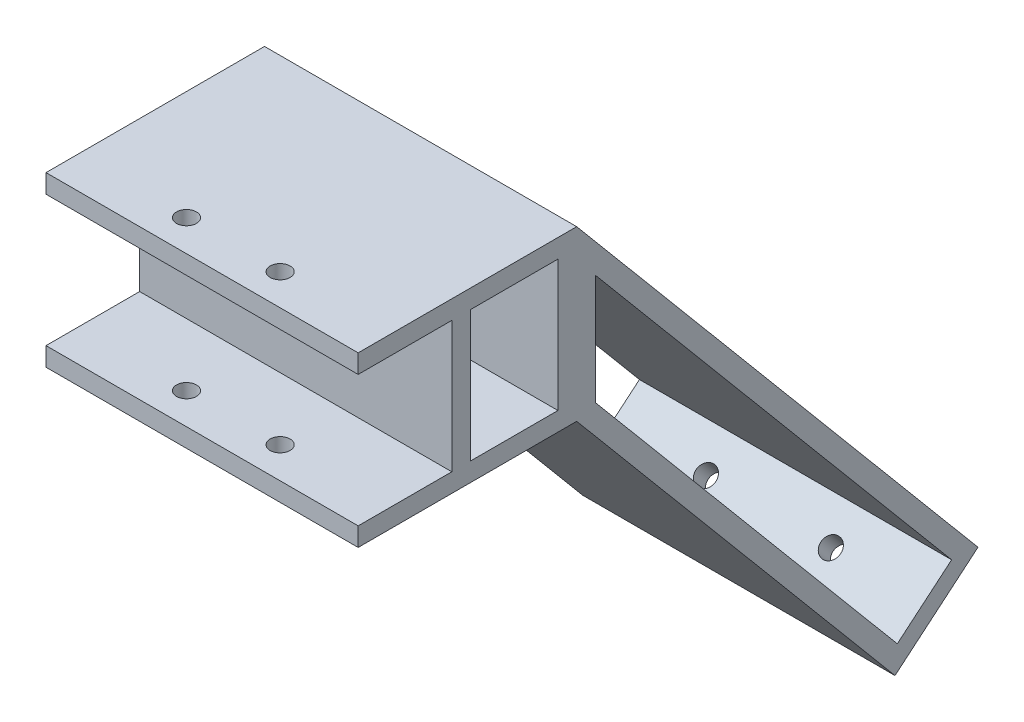
ISO-10303-21;
HEADER;
FILE_DESCRIPTION(('STEP AP214'),'2;1');
FILE_NAME('part.step','',(''),(''),'','','');
FILE_SCHEMA(('AUTOMOTIVE_DESIGN { 1 0 10303 214 1 1 1 1 }'));
ENDSEC;
DATA;
#1=APPLICATION_CONTEXT('core data for automotive mechanical design processes');
#2=APPLICATION_PROTOCOL_DEFINITION('international standard','automotive_design',2000,#1);
#3=PRODUCT_CONTEXT('',#1,'mechanical');
#4=PRODUCT('Part','Part','',(#3));
#5=PRODUCT_RELATED_PRODUCT_CATEGORY('part','',(#4));
#6=PRODUCT_DEFINITION_FORMATION('','',#4);
#7=PRODUCT_DEFINITION_CONTEXT('part definition',#1,'design');
#8=PRODUCT_DEFINITION('design','',#6,#7);
#9=PRODUCT_DEFINITION_SHAPE('','',#8);
#10=(LENGTH_UNIT() NAMED_UNIT(*) SI_UNIT(.MILLI.,.METRE.));
#11=(NAMED_UNIT(*) PLANE_ANGLE_UNIT() SI_UNIT($,.RADIAN.));
#12=(NAMED_UNIT(*) SI_UNIT($,.STERADIAN.) SOLID_ANGLE_UNIT());
#13=UNCERTAINTY_MEASURE_WITH_UNIT(LENGTH_MEASURE(1.E-05),#10,'distance_accuracy_value','');
#14=(GEOMETRIC_REPRESENTATION_CONTEXT(3) GLOBAL_UNCERTAINTY_ASSIGNED_CONTEXT((#13)) GLOBAL_UNIT_ASSIGNED_CONTEXT((#10,
#11,#12)) REPRESENTATION_CONTEXT('',''));
#15=CARTESIAN_POINT('',(0.,0.,0.));
#16=DIRECTION('',(0.,0.,1.));
#17=DIRECTION('',(1.,0.,0.));
#18=AXIS2_PLACEMENT_3D('',#15,#16,#17);
#19=CARTESIAN_POINT('',(0.,0.,35.));
#20=DIRECTION('',(0.,0.,1.));
#21=DIRECTION('',(1.,0.,0.));
#22=AXIS2_PLACEMENT_3D('',#19,#20,#21);
#23=PLANE('',#22);
#24=DIRECTION('',(-1.,0.,0.));
#25=VECTOR('',#24,1.);
#26=CARTESIAN_POINT('',(-21.1991434689508,10.3297644539615,35.));
#27=LINE('',#26,#25);
#28=CARTESIAN_POINT('',(28.8008565310493,10.3297644539615,35.));
#29=VERTEX_POINT('',#28);
#30=CARTESIAN_POINT('',(-21.1991434689508,10.3297644539615,35.));
#31=VERTEX_POINT('',#30);
#32=EDGE_CURVE('E328',#29,#31,#27,.T.);
#33=ORIENTED_EDGE('',*,*,#32,.F.);
#34=DIRECTION('',(0.,1.,0.));
#35=VECTOR('',#34,1.);
#36=CARTESIAN_POINT('',(28.8008565310493,13.3297644539615,35.));
#37=LINE('',#36,#35);
#38=CARTESIAN_POINT('',(28.8008565310493,13.3297644539615,35.));
#39=VERTEX_POINT('',#38);
#40=EDGE_CURVE('E366',#29,#39,#37,.T.);
#41=ORIENTED_EDGE('',*,*,#40,.T.);
#42=DIRECTION('',(-1.,0.,0.));
#43=VECTOR('',#42,1.);
#44=CARTESIAN_POINT('',(-21.1991434689508,13.3297644539615,35.));
#45=LINE('',#44,#43);
#46=CARTESIAN_POINT('',(-21.1991434689508,13.3297644539615,35.));
#47=VERTEX_POINT('',#46);
#48=EDGE_CURVE('E371',#39,#47,#45,.T.);
#49=ORIENTED_EDGE('',*,*,#48,.T.);
#50=DIRECTION('',(0.,-1.,0.));
#51=VECTOR('',#50,1.);
#52=CARTESIAN_POINT('',(-21.1991434689508,13.3297644539615,35.));
#53=LINE('',#52,#51);
#54=EDGE_CURVE('E358',#47,#31,#53,.T.);
#55=ORIENTED_EDGE('',*,*,#54,.T.);
#56=EDGE_LOOP('',(#33,#41,#49,#55));
#57=FACE_BOUND('',#56,.T.);
#58=ADVANCED_FACE('F45',(#57),#23,.T.);
#59=CARTESIAN_POINT('',(-21.1991434689508,13.3297644539615,35.));
#60=DIRECTION('',(1.,0.,0.));
#61=DIRECTION('',(0.,1.,0.));
#62=AXIS2_PLACEMENT_3D('',#59,#60,#61);
#63=PLANE('',#62);
#64=DIRECTION('',(0.,-0.76604444311898,-0.642787609686537));
#65=VECTOR('',#64,1.);
#66=CARTESIAN_POINT('',(-21.1991434689508,-12.57832484324,-3.));
#67=LINE('',#66,#65);
#68=CARTESIAN_POINT('',(-21.1991434689508,-12.57832484324,-3.));
#69=VERTEX_POINT('',#68);
#70=CARTESIAN_POINT('',(-21.1991434689508,-70.2039333010163,-51.3536268032863));
#71=VERTEX_POINT('',#70);
#72=EDGE_CURVE('E182',#69,#71,#67,.T.);
#73=ORIENTED_EDGE('',*,*,#72,.T.);
#74=DIRECTION('',(0.,0.642787609686538,-0.766044443118979));
#75=VECTOR('',#74,1.);
#76=CARTESIAN_POINT('',(-21.1991434689508,-70.2039333010163,-51.3536268032863));
#77=LINE('',#76,#75);
#78=CARTESIAN_POINT('',(-21.1991434689508,-62.9049093576392,-60.0522648102372));
#79=VERTEX_POINT('',#78);
#80=EDGE_CURVE('E175',#71,#79,#77,.T.);
#81=ORIENTED_EDGE('',*,*,#80,.T.);
#82=DIRECTION('',(0.,0.76604444311898,0.642787609686537));
#83=VECTOR('',#82,1.);
#84=CARTESIAN_POINT('',(-21.1991434689508,-62.9049093576392,-60.0522648102372));
#85=LINE('',#84,#83);
#86=CARTESIAN_POINT('',(-21.1991434689508,5.08733219559755,-2.99999999999998));
#87=VERTEX_POINT('',#86);
#88=EDGE_CURVE('E185',#79,#87,#85,.T.);
#89=ORIENTED_EDGE('',*,*,#88,.T.);
#90=DIRECTION('',(0.,-1.,0.));
#91=VECTOR('',#90,1.);
#92=CARTESIAN_POINT('',(-21.1991434689508,5.08733219559754,-3.));
#93=LINE('',#92,#91);
#94=EDGE_CURVE('E63',#87,#69,#93,.T.);
#95=ORIENTED_EDGE('',*,*,#94,.T.);
#96=EDGE_LOOP('',(#73,#81,#89,#95));
#97=FACE_BOUND('',#96,.T.);
#98=DIRECTION('',(0.,0.,1.));
#99=VECTOR('',#98,1.);
#100=CARTESIAN_POINT('',(-21.1991434689507,-10.6702355460385,3.));
#101=LINE('',#100,#99);
#102=CARTESIAN_POINT('',(-21.1991434689507,-10.6702355460385,3.));
#103=VERTEX_POINT('',#102);
#104=CARTESIAN_POINT('',(-21.1991434689507,-10.6702355460385,17.));
#105=VERTEX_POINT('',#104);
#106=EDGE_CURVE('E273',#103,#105,#101,.T.);
#107=ORIENTED_EDGE('',*,*,#106,.F.);
#108=DIRECTION('',(0.,-1.,0.));
#109=VECTOR('',#108,1.);
#110=CARTESIAN_POINT('',(-21.1991434689508,10.3297644539615,3.));
#111=LINE('',#110,#109);
#112=CARTESIAN_POINT('',(-21.1991434689508,10.3297644539615,3.));
#113=VERTEX_POINT('',#112);
#114=EDGE_CURVE('E250',#113,#103,#111,.T.);
#115=ORIENTED_EDGE('',*,*,#114,.F.);
#116=DIRECTION('',(0.,0.,-1.));
#117=VECTOR('',#116,1.);
#118=CARTESIAN_POINT('',(-21.1991434689508,10.3297644539615,3.));
#119=LINE('',#118,#117);
#120=CARTESIAN_POINT('',(-21.1991434689508,10.3297644539615,17.));
#121=VERTEX_POINT('',#120);
#122=EDGE_CURVE('E258',#121,#113,#119,.T.);
#123=ORIENTED_EDGE('',*,*,#122,.F.);
#124=DIRECTION('',(0.,1.,0.));
#125=VECTOR('',#124,1.);
#126=CARTESIAN_POINT('',(-21.1991434689508,10.3297644539615,17.));
#127=LINE('',#126,#125);
#128=EDGE_CURVE('E277',#105,#121,#127,.T.);
#129=ORIENTED_EDGE('',*,*,#128,.F.);
#130=EDGE_LOOP('',(#107,#115,#123,#129));
#131=FACE_BOUND('',#130,.T.);
#132=DIRECTION('',(0.,-1.,0.));
#133=VECTOR('',#132,1.);
#134=CARTESIAN_POINT('',(-21.1991434689508,10.3297644539615,20.));
#135=LINE('',#134,#133);
#136=CARTESIAN_POINT('',(-21.1991434689508,10.3297644539615,20.));
#137=VERTEX_POINT('',#136);
#138=CARTESIAN_POINT('',(-21.1991434689508,-10.6702355460385,20.));
#139=VERTEX_POINT('',#138);
#140=EDGE_CURVE('E323',#137,#139,#135,.T.);
#141=ORIENTED_EDGE('',*,*,#140,.F.);
#142=DIRECTION('',(0.,0.,1.));
#143=VECTOR('',#142,1.);
#144=CARTESIAN_POINT('',(-21.1991434689508,10.3297644539615,20.));
#145=LINE('',#144,#143);
#146=EDGE_CURVE('E344',#137,#31,#145,.T.);
#147=ORIENTED_EDGE('',*,*,#146,.T.);
#148=ORIENTED_EDGE('',*,*,#54,.F.);
#149=DIRECTION('',(0.,0.,-1.));
#150=VECTOR('',#149,1.);
#151=CARTESIAN_POINT('',(-21.1991434689508,13.3297644539615,35.));
#152=LINE('',#151,#150);
#153=CARTESIAN_POINT('',(-21.1991434689508,13.3297644539614,0.));
#154=VERTEX_POINT('',#153);
#155=EDGE_CURVE('E374',#47,#154,#152,.T.);
#156=ORIENTED_EDGE('',*,*,#155,.T.);
#157=DIRECTION('',(0.,0.766044443118979,0.642787609686538));
#158=VECTOR('',#157,1.);
#159=CARTESIAN_POINT('',(-21.1991434689507,-63.2746798579365,-64.2787609686538));
#160=LINE('',#159,#158);
#161=CARTESIAN_POINT('',(-21.1991434689507,-63.2746798579365,-64.2787609686538));
#162=VERTEX_POINT('',#161);
#163=EDGE_CURVE('E233',#162,#154,#160,.T.);
#164=ORIENTED_EDGE('',*,*,#163,.F.);
#165=DIRECTION('',(0.,0.642787609686537,-0.76604444311898));
#166=VECTOR('',#165,1.);
#167=CARTESIAN_POINT('',(-21.1991434689507,-74.4304294594329,-50.983856302989));
#168=LINE('',#167,#166);
#169=CARTESIAN_POINT('',(-21.1991434689507,-74.4304294594329,-50.983856302989));
#170=VERTEX_POINT('',#169);
#171=EDGE_CURVE('E228',#170,#162,#168,.T.);
#172=ORIENTED_EDGE('',*,*,#171,.F.);
#173=DIRECTION('',(0.,-0.766044443118979,-0.642787609686538));
#174=VECTOR('',#173,1.);
#175=CARTESIAN_POINT('',(-21.1991434689507,-13.6702355460386,0.));
#176=LINE('',#175,#174);
#177=CARTESIAN_POINT('',(-21.1991434689507,-13.6702355460386,0.));
#178=VERTEX_POINT('',#177);
#179=EDGE_CURVE('E224',#178,#170,#176,.T.);
#180=ORIENTED_EDGE('',*,*,#179,.F.);
#181=DIRECTION('',(0.,0.,-1.));
#182=VECTOR('',#181,1.);
#183=CARTESIAN_POINT('',(-21.1991434689507,-13.6702355460385,35.));
#184=LINE('',#183,#182);
#185=CARTESIAN_POINT('',(-21.1991434689507,-13.6702355460385,35.));
#186=VERTEX_POINT('',#185);
#187=EDGE_CURVE('E11',#186,#178,#184,.T.);
#188=ORIENTED_EDGE('',*,*,#187,.F.);
#189=CARTESIAN_POINT('',(-21.1991434689507,-10.6702355460385,35.));
#190=VERTEX_POINT('',#189);
#191=EDGE_CURVE('E363',#190,#186,#53,.T.);
#192=ORIENTED_EDGE('',*,*,#191,.F.);
#193=DIRECTION('',(0.,0.,1.));
#194=VECTOR('',#193,1.);
#195=CARTESIAN_POINT('',(-21.1991434689508,-10.6702355460385,20.));
#196=LINE('',#195,#194);
#197=EDGE_CURVE('E339',#139,#190,#196,.T.);
#198=ORIENTED_EDGE('',*,*,#197,.F.);
#199=EDGE_LOOP('',(#141,#147,#148,#156,#164,#172,#180,#188,#192,#198));
#200=FACE_BOUND('',#199,.T.);
#201=ADVANCED_FACE('F47',(#97,#131,#200),#63,.F.);
#202=CARTESIAN_POINT('',(-21.1991434689507,-13.6702355460385,35.));
#203=DIRECTION('',(0.,1.,0.));
#204=DIRECTION('',(0.,0.,1.));
#205=AXIS2_PLACEMENT_3D('',#202,#203,#204);
#206=PLANE('',#205);
#207=CARTESIAN_POINT('',(11.3008565310493,-13.6702355460385,30.));
#208=DIRECTION('',(0.,-1.,0.));
#209=DIRECTION('',(0.,0.,-1.));
#210=AXIS2_PLACEMENT_3D('',#207,#208,#209);
#211=CIRCLE('',#210,1.6);
#212=CARTESIAN_POINT('',(11.3008565310493,-13.6702355460385,28.4));
#213=VERTEX_POINT('',#212);
#214=EDGE_CURVE('E302',#213,#213,#211,.T.);
#215=ORIENTED_EDGE('',*,*,#214,.F.);
#216=EDGE_LOOP('',(#215));
#217=FACE_BOUND('',#216,.T.);
#218=CARTESIAN_POINT('',(-3.69914346895074,-13.6702355460385,30.));
#219=DIRECTION('',(0.,-1.,0.));
#220=DIRECTION('',(0.,0.,-1.));
#221=AXIS2_PLACEMENT_3D('',#218,#219,#220);
#222=CIRCLE('',#221,1.6);
#223=CARTESIAN_POINT('',(-3.69914346895074,-13.6702355460385,28.4));
#224=VERTEX_POINT('',#223);
#225=EDGE_CURVE('E306',#224,#224,#222,.T.);
#226=ORIENTED_EDGE('',*,*,#225,.F.);
#227=EDGE_LOOP('',(#226));
#228=FACE_BOUND('',#227,.T.);
#229=DIRECTION('',(1.,0.,0.));
#230=VECTOR('',#229,1.);
#231=CARTESIAN_POINT('',(-21.1991434689507,-13.6702355460385,0.));
#232=LINE('',#231,#230);
#233=CARTESIAN_POINT('',(28.8008565310493,-13.6702355460385,0.));
#234=VERTEX_POINT('',#233);
#235=EDGE_CURVE('E348',#178,#234,#232,.T.);
#236=ORIENTED_EDGE('',*,*,#235,.T.);
#237=DIRECTION('',(0.,0.,-1.));
#238=VECTOR('',#237,1.);
#239=CARTESIAN_POINT('',(28.8008565310493,-13.6702355460385,35.));
#240=LINE('',#239,#238);
#241=CARTESIAN_POINT('',(28.8008565310493,-13.6702355460385,35.));
#242=VERTEX_POINT('',#241);
#243=EDGE_CURVE('E55',#242,#234,#240,.T.);
#244=ORIENTED_EDGE('',*,*,#243,.F.);
#245=DIRECTION('',(1.,0.,0.));
#246=VECTOR('',#245,1.);
#247=CARTESIAN_POINT('',(-21.1991434689507,-13.6702355460385,35.));
#248=LINE('',#247,#246);
#249=EDGE_CURVE('E362',#186,#242,#248,.T.);
#250=ORIENTED_EDGE('',*,*,#249,.F.);
#251=ORIENTED_EDGE('',*,*,#187,.T.);
#252=EDGE_LOOP('',(#236,#244,#250,#251));
#253=FACE_BOUND('',#252,.T.);
#254=ADVANCED_FACE('F434',(#217,#228,#253),#206,.F.);
#255=CARTESIAN_POINT('',(28.8008565310493,13.3297644539615,35.));
#256=DIRECTION('',(-1.,0.,0.));
#257=DIRECTION('',(0.,-1.,0.));
#258=AXIS2_PLACEMENT_3D('',#255,#256,#257);
#259=PLANE('',#258);
#260=DIRECTION('',(0.,0.76604444311898,0.642787609686537));
#261=VECTOR('',#260,1.);
#262=CARTESIAN_POINT('',(28.8008565310493,-62.9049093576392,-60.0522648102372));
#263=LINE('',#262,#261);
#264=CARTESIAN_POINT('',(28.8008565310493,-62.9049093576392,-60.0522648102372));
#265=VERTEX_POINT('',#264);
#266=CARTESIAN_POINT('',(28.8008565310493,5.08733219559755,-3.));
#267=VERTEX_POINT('',#266);
#268=EDGE_CURVE('E209',#265,#267,#263,.T.);
#269=ORIENTED_EDGE('',*,*,#268,.F.);
#270=DIRECTION('',(0.,0.642787609686538,-0.766044443118979));
#271=VECTOR('',#270,1.);
#272=CARTESIAN_POINT('',(28.8008565310493,-70.2039333010163,-51.3536268032863));
#273=LINE('',#272,#271);
#274=CARTESIAN_POINT('',(28.8008565310493,-70.2039333010163,-51.3536268032863));
#275=VERTEX_POINT('',#274);
#276=EDGE_CURVE('E71',#275,#265,#273,.T.);
#277=ORIENTED_EDGE('',*,*,#276,.F.);
#278=DIRECTION('',(0.,-0.76604444311898,-0.642787609686537));
#279=VECTOR('',#278,1.);
#280=CARTESIAN_POINT('',(28.8008565310493,-12.5783248432399,-3.));
#281=LINE('',#280,#279);
#282=CARTESIAN_POINT('',(28.8008565310493,-12.5783248432399,-3.));
#283=VERTEX_POINT('',#282);
#284=EDGE_CURVE('E193',#283,#275,#281,.T.);
#285=ORIENTED_EDGE('',*,*,#284,.F.);
#286=DIRECTION('',(0.,-1.,0.));
#287=VECTOR('',#286,1.);
#288=CARTESIAN_POINT('',(28.8008565310493,5.08733219559755,-3.));
#289=LINE('',#288,#287);
#290=EDGE_CURVE('E197',#267,#283,#289,.T.);
#291=ORIENTED_EDGE('',*,*,#290,.F.);
#292=EDGE_LOOP('',(#269,#277,#285,#291));
#293=FACE_BOUND('',#292,.T.);
#294=DIRECTION('',(0.,0.,-1.));
#295=VECTOR('',#294,1.);
#296=CARTESIAN_POINT('',(28.8008565310493,10.3297644539615,3.));
#297=LINE('',#296,#295);
#298=CARTESIAN_POINT('',(28.8008565310493,10.3297644539615,17.));
#299=VERTEX_POINT('',#298);
#300=CARTESIAN_POINT('',(28.8008565310493,10.3297644539615,3.));
#301=VERTEX_POINT('',#300);
#302=EDGE_CURVE('E266',#299,#301,#297,.T.);
#303=ORIENTED_EDGE('',*,*,#302,.T.);
#304=DIRECTION('',(0.,-1.,0.));
#305=VECTOR('',#304,1.);
#306=CARTESIAN_POINT('',(28.8008565310493,10.3297644539615,3.));
#307=LINE('',#306,#305);
#308=CARTESIAN_POINT('',(28.8008565310493,-10.6702355460385,3.));
#309=VERTEX_POINT('',#308);
#310=EDGE_CURVE('E253',#301,#309,#307,.T.);
#311=ORIENTED_EDGE('',*,*,#310,.T.);
#312=DIRECTION('',(0.,0.,1.));
#313=VECTOR('',#312,1.);
#314=CARTESIAN_POINT('',(28.8008565310493,-10.6702355460385,3.));
#315=LINE('',#314,#313);
#316=CARTESIAN_POINT('',(28.8008565310493,-10.6702355460385,17.));
#317=VERTEX_POINT('',#316);
#318=EDGE_CURVE('E257',#309,#317,#315,.T.);
#319=ORIENTED_EDGE('',*,*,#318,.T.);
#320=DIRECTION('',(0.,1.,0.));
#321=VECTOR('',#320,1.);
#322=CARTESIAN_POINT('',(28.8008565310493,10.3297644539615,17.));
#323=LINE('',#322,#321);
#324=EDGE_CURVE('E262',#317,#299,#323,.T.);
#325=ORIENTED_EDGE('',*,*,#324,.T.);
#326=EDGE_LOOP('',(#303,#311,#319,#325));
#327=FACE_BOUND('',#326,.T.);
#328=ORIENTED_EDGE('',*,*,#40,.F.);
#329=DIRECTION('',(0.,0.,1.));
#330=VECTOR('',#329,1.);
#331=CARTESIAN_POINT('',(28.8008565310493,10.3297644539615,20.));
#332=LINE('',#331,#330);
#333=CARTESIAN_POINT('',(28.8008565310493,10.3297644539615,20.));
#334=VERTEX_POINT('',#333);
#335=EDGE_CURVE('E349',#334,#29,#332,.T.);
#336=ORIENTED_EDGE('',*,*,#335,.F.);
#337=DIRECTION('',(0.,1.,0.));
#338=VECTOR('',#337,1.);
#339=CARTESIAN_POINT('',(28.8008565310493,10.3297644539615,20.));
#340=LINE('',#339,#338);
#341=CARTESIAN_POINT('',(28.8008565310493,-10.6702355460385,20.));
#342=VERTEX_POINT('',#341);
#343=EDGE_CURVE('E332',#342,#334,#340,.T.);
#344=ORIENTED_EDGE('',*,*,#343,.F.);
#345=DIRECTION('',(0.,0.,1.));
#346=VECTOR('',#345,1.);
#347=CARTESIAN_POINT('',(28.8008565310493,-10.6702355460385,20.));
#348=LINE('',#347,#346);
#349=CARTESIAN_POINT('',(28.8008565310493,-10.6702355460385,35.));
#350=VERTEX_POINT('',#349);
#351=EDGE_CURVE('E352',#342,#350,#348,.T.);
#352=ORIENTED_EDGE('',*,*,#351,.T.);
#353=EDGE_CURVE('E367',#242,#350,#37,.T.);
#354=ORIENTED_EDGE('',*,*,#353,.F.);
#355=ORIENTED_EDGE('',*,*,#243,.T.);
#356=DIRECTION('',(0.,-0.766044443118979,-0.642787609686538));
#357=VECTOR('',#356,1.);
#358=CARTESIAN_POINT('',(28.8008565310493,-13.6702355460385,0.));
#359=LINE('',#358,#357);
#360=CARTESIAN_POINT('',(28.8008565310493,-74.4304294594329,-50.983856302989));
#361=VERTEX_POINT('',#360);
#362=EDGE_CURVE('E218',#234,#361,#359,.T.);
#363=ORIENTED_EDGE('',*,*,#362,.T.);
#364=DIRECTION('',(0.,0.642787609686537,-0.76604444311898));
#365=VECTOR('',#364,1.);
#366=CARTESIAN_POINT('',(28.8008565310493,-74.4304294594329,-50.983856302989));
#367=LINE('',#366,#365);
#368=CARTESIAN_POINT('',(28.8008565310493,-63.2746798579365,-64.2787609686538));
#369=VERTEX_POINT('',#368);
#370=EDGE_CURVE('E240',#361,#369,#367,.T.);
#371=ORIENTED_EDGE('',*,*,#370,.T.);
#372=DIRECTION('',(0.,0.766044443118979,0.642787609686538));
#373=VECTOR('',#372,1.);
#374=CARTESIAN_POINT('',(28.8008565310493,-63.2746798579365,-64.2787609686538));
#375=LINE('',#374,#373);
#376=CARTESIAN_POINT('',(28.8008565310493,13.3297644539615,0.));
#377=VERTEX_POINT('',#376);
#378=EDGE_CURVE('E229',#369,#377,#375,.T.);
#379=ORIENTED_EDGE('',*,*,#378,.T.);
#380=DIRECTION('',(0.,0.,-1.));
#381=VECTOR('',#380,1.);
#382=CARTESIAN_POINT('',(28.8008565310493,13.3297644539615,35.));
#383=LINE('',#382,#381);
#384=EDGE_CURVE('E385',#39,#377,#383,.T.);
#385=ORIENTED_EDGE('',*,*,#384,.F.);
#386=EDGE_LOOP('',(#328,#336,#344,#352,#354,#355,#363,#371,#379,#385));
#387=FACE_BOUND('',#386,.T.);
#388=ADVANCED_FACE('F428',(#293,#327,#387),#259,.F.);
#389=CARTESIAN_POINT('',(-21.1991434689508,13.3297644539615,35.));
#390=DIRECTION('',(0.,-1.,0.));
#391=DIRECTION('',(0.,0.,-1.));
#392=AXIS2_PLACEMENT_3D('',#389,#390,#391);
#393=PLANE('',#392);
#394=CARTESIAN_POINT('',(11.3008565310493,13.3297644539615,30.));
#395=DIRECTION('',(0.,-1.,0.));
#396=DIRECTION('',(0.,0.,-1.));
#397=AXIS2_PLACEMENT_3D('',#394,#395,#396);
#398=CIRCLE('',#397,1.6);
#399=CARTESIAN_POINT('',(11.3008565310493,13.3297644539615,28.4));
#400=VERTEX_POINT('',#399);
#401=EDGE_CURVE('E297',#400,#400,#398,.T.);
#402=ORIENTED_EDGE('',*,*,#401,.T.);
#403=EDGE_LOOP('',(#402));
#404=FACE_BOUND('',#403,.T.);
#405=CARTESIAN_POINT('',(-3.69914346895074,13.3297644539615,30.));
#406=DIRECTION('',(0.,-1.,0.));
#407=DIRECTION('',(0.,0.,-1.));
#408=AXIS2_PLACEMENT_3D('',#405,#406,#407);
#409=CIRCLE('',#408,1.6);
#410=CARTESIAN_POINT('',(-3.69914346895074,13.3297644539615,28.4));
#411=VERTEX_POINT('',#410);
#412=EDGE_CURVE('E287',#411,#411,#409,.T.);
#413=ORIENTED_EDGE('',*,*,#412,.T.);
#414=EDGE_LOOP('',(#413));
#415=FACE_BOUND('',#414,.T.);
#416=DIRECTION('',(-1.,0.,0.));
#417=VECTOR('',#416,1.);
#418=CARTESIAN_POINT('',(-21.1991434689508,13.3297644539615,0.));
#419=LINE('',#418,#417);
#420=EDGE_CURVE('E378',#377,#154,#419,.T.);
#421=ORIENTED_EDGE('',*,*,#420,.T.);
#422=ORIENTED_EDGE('',*,*,#155,.F.);
#423=ORIENTED_EDGE('',*,*,#48,.F.);
#424=ORIENTED_EDGE('',*,*,#384,.T.);
#425=EDGE_LOOP('',(#421,#422,#423,#424));
#426=FACE_BOUND('',#425,.T.);
#427=ADVANCED_FACE('F446',(#404,#415,#426),#393,.F.);
#428=DIRECTION('',(1.,0.,0.));
#429=VECTOR('',#428,1.);
#430=CARTESIAN_POINT('',(-21.1991434689508,-10.6702355460385,35.));
#431=LINE('',#430,#429);
#432=EDGE_CURVE('E322',#190,#350,#431,.T.);
#433=ORIENTED_EDGE('',*,*,#432,.F.);
#434=ORIENTED_EDGE('',*,*,#191,.T.);
#435=ORIENTED_EDGE('',*,*,#249,.T.);
#436=ORIENTED_EDGE('',*,*,#353,.T.);
#437=EDGE_LOOP('',(#433,#434,#435,#436));
#438=FACE_BOUND('',#437,.T.);
#439=ADVANCED_FACE('F457',(#438),#23,.T.);
#440=CARTESIAN_POINT('',(-21.1991434689508,10.3297644539615,20.));
#441=DIRECTION('',(0.,1.,0.));
#442=DIRECTION('',(0.,0.,1.));
#443=AXIS2_PLACEMENT_3D('',#440,#441,#442);
#444=PLANE('',#443);
#445=CARTESIAN_POINT('',(11.3008565310493,10.3297644539615,30.));
#446=DIRECTION('',(0.,1.,0.));
#447=DIRECTION('',(0.,0.,1.));
#448=AXIS2_PLACEMENT_3D('',#445,#446,#447);
#449=CIRCLE('',#448,1.6);
#450=CARTESIAN_POINT('',(11.3008565310493,10.3297644539615,31.6));
#451=VERTEX_POINT('',#450);
#452=EDGE_CURVE('E318',#451,#451,#449,.T.);
#453=ORIENTED_EDGE('',*,*,#452,.T.);
#454=EDGE_LOOP('',(#453));
#455=FACE_BOUND('',#454,.T.);
#456=CARTESIAN_POINT('',(-3.69914346895074,10.3297644539615,30.));
#457=DIRECTION('',(0.,1.,0.));
#458=DIRECTION('',(0.,0.,1.));
#459=AXIS2_PLACEMENT_3D('',#456,#457,#458);
#460=CIRCLE('',#459,1.6);
#461=CARTESIAN_POINT('',(-3.69914346895074,10.3297644539615,31.6));
#462=VERTEX_POINT('',#461);
#463=EDGE_CURVE('E313',#462,#462,#460,.T.);
#464=ORIENTED_EDGE('',*,*,#463,.T.);
#465=EDGE_LOOP('',(#464));
#466=FACE_BOUND('',#465,.T.);
#467=ORIENTED_EDGE('',*,*,#32,.T.);
#468=ORIENTED_EDGE('',*,*,#146,.F.);
#469=DIRECTION('',(-1.,0.,0.));
#470=VECTOR('',#469,1.);
#471=CARTESIAN_POINT('',(-21.1991434689508,10.3297644539615,20.));
#472=LINE('',#471,#470);
#473=EDGE_CURVE('E335',#334,#137,#472,.T.);
#474=ORIENTED_EDGE('',*,*,#473,.F.);
#475=ORIENTED_EDGE('',*,*,#335,.T.);
#476=EDGE_LOOP('',(#467,#468,#474,#475));
#477=FACE_BOUND('',#476,.T.);
#478=ADVANCED_FACE('F464',(#455,#466,#477),#444,.F.);
#479=CARTESIAN_POINT('',(-21.1991434689508,-10.6702355460385,20.));
#480=DIRECTION('',(0.,-1.,0.));
#481=DIRECTION('',(0.,0.,-1.));
#482=AXIS2_PLACEMENT_3D('',#479,#480,#481);
#483=PLANE('',#482);
#484=CARTESIAN_POINT('',(11.3008565310493,-10.6702355460385,30.));
#485=DIRECTION('',(0.,-1.,0.));
#486=DIRECTION('',(0.,0.,-1.));
#487=AXIS2_PLACEMENT_3D('',#484,#485,#486);
#488=CIRCLE('',#487,1.6);
#489=CARTESIAN_POINT('',(11.3008565310493,-10.6702355460385,28.4));
#490=VERTEX_POINT('',#489);
#491=EDGE_CURVE('E317',#490,#490,#488,.T.);
#492=ORIENTED_EDGE('',*,*,#491,.T.);
#493=EDGE_LOOP('',(#492));
#494=FACE_BOUND('',#493,.T.);
#495=CARTESIAN_POINT('',(-3.69914346895074,-10.6702355460385,30.));
#496=DIRECTION('',(0.,-1.,0.));
#497=DIRECTION('',(0.,0.,-1.));
#498=AXIS2_PLACEMENT_3D('',#495,#496,#497);
#499=CIRCLE('',#498,1.6);
#500=CARTESIAN_POINT('',(-3.69914346895074,-10.6702355460385,28.4));
#501=VERTEX_POINT('',#500);
#502=EDGE_CURVE('E301',#501,#501,#499,.T.);
#503=ORIENTED_EDGE('',*,*,#502,.T.);
#504=EDGE_LOOP('',(#503));
#505=FACE_BOUND('',#504,.T.);
#506=ORIENTED_EDGE('',*,*,#432,.T.);
#507=ORIENTED_EDGE('',*,*,#351,.F.);
#508=DIRECTION('',(1.,0.,0.));
#509=VECTOR('',#508,1.);
#510=CARTESIAN_POINT('',(-21.1991434689508,-10.6702355460385,20.));
#511=LINE('',#510,#509);
#512=EDGE_CURVE('E327',#139,#342,#511,.T.);
#513=ORIENTED_EDGE('',*,*,#512,.F.);
#514=ORIENTED_EDGE('',*,*,#197,.T.);
#515=EDGE_LOOP('',(#506,#507,#513,#514));
#516=FACE_BOUND('',#515,.T.);
#517=ADVANCED_FACE('F459',(#494,#505,#516),#483,.F.);
#518=CARTESIAN_POINT('',(0.,0.,20.));
#519=DIRECTION('',(0.,0.,1.));
#520=DIRECTION('',(1.,0.,0.));
#521=AXIS2_PLACEMENT_3D('',#518,#519,#520);
#522=PLANE('',#521);
#523=ORIENTED_EDGE('',*,*,#140,.T.);
#524=ORIENTED_EDGE('',*,*,#512,.T.);
#525=ORIENTED_EDGE('',*,*,#343,.T.);
#526=ORIENTED_EDGE('',*,*,#473,.T.);
#527=EDGE_LOOP('',(#523,#524,#525,#526));
#528=FACE_BOUND('',#527,.T.);
#529=ADVANCED_FACE('F462',(#528),#522,.T.);
#530=CARTESIAN_POINT('',(-3.69914346895074,13.3297644539615,30.));
#531=DIRECTION('',(0.,-1.,0.));
#532=DIRECTION('',(0.,0.,-1.));
#533=AXIS2_PLACEMENT_3D('',#530,#531,#532);
#534=CYLINDRICAL_SURFACE('',#533,1.6);
#535=ORIENTED_EDGE('',*,*,#225,.T.);
#536=EDGE_LOOP('',(#535));
#537=FACE_BOUND('',#536,.T.);
#538=ORIENTED_EDGE('',*,*,#502,.F.);
#539=EDGE_LOOP('',(#538));
#540=FACE_BOUND('',#539,.T.);
#541=ADVANCED_FACE('F497',(#537,#540),#534,.F.);
#542=CARTESIAN_POINT('',(11.3008565310493,13.3297644539615,30.));
#543=DIRECTION('',(0.,-1.,0.));
#544=DIRECTION('',(0.,0.,-1.));
#545=AXIS2_PLACEMENT_3D('',#542,#543,#544);
#546=CYLINDRICAL_SURFACE('',#545,1.6);
#547=ORIENTED_EDGE('',*,*,#214,.T.);
#548=EDGE_LOOP('',(#547));
#549=FACE_BOUND('',#548,.T.);
#550=ORIENTED_EDGE('',*,*,#491,.F.);
#551=EDGE_LOOP('',(#550));
#552=FACE_BOUND('',#551,.T.);
#553=ADVANCED_FACE('F500',(#549,#552),#546,.F.);
#554=ORIENTED_EDGE('',*,*,#412,.F.);
#555=EDGE_LOOP('',(#554));
#556=FACE_BOUND('',#555,.T.);
#557=ORIENTED_EDGE('',*,*,#463,.F.);
#558=EDGE_LOOP('',(#557));
#559=FACE_BOUND('',#558,.T.);
#560=ADVANCED_FACE('F502',(#556,#559),#534,.F.);
#561=ORIENTED_EDGE('',*,*,#401,.F.);
#562=EDGE_LOOP('',(#561));
#563=FACE_BOUND('',#562,.T.);
#564=ORIENTED_EDGE('',*,*,#452,.F.);
#565=EDGE_LOOP('',(#564));
#566=FACE_BOUND('',#565,.T.);
#567=ADVANCED_FACE('F512',(#563,#566),#546,.F.);
#568=CARTESIAN_POINT('',(28.8008565310493,10.3297644539615,3.));
#569=DIRECTION('',(0.,0.,-1.));
#570=DIRECTION('',(0.,1.,0.));
#571=AXIS2_PLACEMENT_3D('',#568,#569,#570);
#572=PLANE('',#571);
#573=ORIENTED_EDGE('',*,*,#114,.T.);
#574=DIRECTION('',(-1.,0.,0.));
#575=VECTOR('',#574,1.);
#576=CARTESIAN_POINT('',(28.8008565310493,-10.6702355460385,3.));
#577=LINE('',#576,#575);
#578=EDGE_CURVE('E270',#309,#103,#577,.T.);
#579=ORIENTED_EDGE('',*,*,#578,.F.);
#580=ORIENTED_EDGE('',*,*,#310,.F.);
#581=DIRECTION('',(-1.,0.,0.));
#582=VECTOR('',#581,1.);
#583=CARTESIAN_POINT('',(28.8008565310493,10.3297644539615,3.));
#584=LINE('',#583,#582);
#585=EDGE_CURVE('E284',#301,#113,#584,.T.);
#586=ORIENTED_EDGE('',*,*,#585,.T.);
#587=EDGE_LOOP('',(#573,#579,#580,#586));
#588=FACE_BOUND('',#587,.T.);
#589=ADVANCED_FACE('F516',(#588),#572,.F.);
#590=CARTESIAN_POINT('',(28.8008565310493,10.3297644539615,3.));
#591=DIRECTION('',(0.,1.,0.));
#592=DIRECTION('',(-1.,0.,0.));
#593=AXIS2_PLACEMENT_3D('',#590,#591,#592);
#594=PLANE('',#593);
#595=ORIENTED_EDGE('',*,*,#122,.T.);
#596=ORIENTED_EDGE('',*,*,#585,.F.);
#597=ORIENTED_EDGE('',*,*,#302,.F.);
#598=DIRECTION('',(-1.,0.,0.));
#599=VECTOR('',#598,1.);
#600=CARTESIAN_POINT('',(28.8008565310493,10.3297644539615,17.));
#601=LINE('',#600,#599);
#602=EDGE_CURVE('E288',#299,#121,#601,.T.);
#603=ORIENTED_EDGE('',*,*,#602,.T.);
#604=EDGE_LOOP('',(#595,#596,#597,#603));
#605=FACE_BOUND('',#604,.T.);
#606=ADVANCED_FACE('F520',(#605),#594,.F.);
#607=CARTESIAN_POINT('',(28.8008565310493,10.3297644539615,17.));
#608=DIRECTION('',(0.,0.,1.));
#609=DIRECTION('',(0.,-1.,0.));
#610=AXIS2_PLACEMENT_3D('',#607,#608,#609);
#611=PLANE('',#610);
#612=ORIENTED_EDGE('',*,*,#128,.T.);
#613=ORIENTED_EDGE('',*,*,#602,.F.);
#614=ORIENTED_EDGE('',*,*,#324,.F.);
#615=DIRECTION('',(-1.,0.,0.));
#616=VECTOR('',#615,1.);
#617=CARTESIAN_POINT('',(28.8008565310493,-10.6702355460385,17.));
#618=LINE('',#617,#616);
#619=EDGE_CURVE('E291',#317,#105,#618,.T.);
#620=ORIENTED_EDGE('',*,*,#619,.T.);
#621=EDGE_LOOP('',(#612,#613,#614,#620));
#622=FACE_BOUND('',#621,.T.);
#623=ADVANCED_FACE('F524',(#622),#611,.F.);
#624=CARTESIAN_POINT('',(28.8008565310493,-10.6702355460385,3.));
#625=DIRECTION('',(0.,-1.,0.));
#626=DIRECTION('',(1.,0.,0.));
#627=AXIS2_PLACEMENT_3D('',#624,#625,#626);
#628=PLANE('',#627);
#629=ORIENTED_EDGE('',*,*,#106,.T.);
#630=ORIENTED_EDGE('',*,*,#619,.F.);
#631=ORIENTED_EDGE('',*,*,#318,.F.);
#632=ORIENTED_EDGE('',*,*,#578,.T.);
#633=EDGE_LOOP('',(#629,#630,#631,#632));
#634=FACE_BOUND('',#633,.T.);
#635=ADVANCED_FACE('F522',(#634),#628,.F.);
#636=CARTESIAN_POINT('',(-21.1991434689507,-63.2746798579365,-64.2787609686538));
#637=DIRECTION('',(0.,0.642787609686538,-0.766044443118979));
#638=DIRECTION('',(0.,0.766044443118979,0.642787609686538));
#639=AXIS2_PLACEMENT_3D('',#636,#637,#638);
#640=PLANE('',#639);
#641=ORIENTED_EDGE('',*,*,#378,.F.);
#642=DIRECTION('',(1.,0.,0.));
#643=VECTOR('',#642,1.);
#644=CARTESIAN_POINT('',(-21.1991434689507,-63.2746798579365,-64.2787609686538));
#645=LINE('',#644,#643);
#646=EDGE_CURVE('E247',#162,#369,#645,.T.);
#647=ORIENTED_EDGE('',*,*,#646,.F.);
#648=ORIENTED_EDGE('',*,*,#163,.T.);
#649=ORIENTED_EDGE('',*,*,#420,.F.);
#650=EDGE_LOOP('',(#641,#647,#648,#649));
#651=FACE_BOUND('',#650,.T.);
#652=ADVANCED_FACE('F420',(#651),#640,.T.);
#653=CARTESIAN_POINT('',(-21.1991434689507,-74.4304294594329,-50.983856302989));
#654=DIRECTION('',(0.,-0.76604444311898,-0.642787609686537));
#655=DIRECTION('',(0.,0.642787609686537,-0.76604444311898));
#656=AXIS2_PLACEMENT_3D('',#653,#654,#655);
#657=PLANE('',#656);
#658=CARTESIAN_POINT('',(13.8008565310493,-68.8525546586847,-57.6313086358214));
#659=DIRECTION('',(0.,-0.76604444311898,-0.642787609686537));
#660=DIRECTION('',(0.,0.642787609686537,-0.76604444311898));
#661=AXIS2_PLACEMENT_3D('',#658,#659,#660);
#662=CIRCLE('',#661,1.6);
#663=CARTESIAN_POINT('',(13.8008565310493,-67.8240944831862,-58.8569797448118));
#664=VERTEX_POINT('',#663);
#665=EDGE_CURVE('E400',#664,#664,#662,.T.);
#666=ORIENTED_EDGE('',*,*,#665,.F.);
#667=EDGE_LOOP('',(#666));
#668=FACE_BOUND('',#667,.T.);
#669=CARTESIAN_POINT('',(-6.19914346895073,-68.8525546586847,-57.6313086358214));
#670=DIRECTION('',(0.,-0.76604444311898,-0.642787609686537));
#671=DIRECTION('',(0.,0.642787609686537,-0.76604444311898));
#672=AXIS2_PLACEMENT_3D('',#669,#670,#671);
#673=CIRCLE('',#672,1.6);
#674=CARTESIAN_POINT('',(-6.19914346895073,-67.8240944831862,-58.8569797448118));
#675=VERTEX_POINT('',#674);
#676=EDGE_CURVE('E200',#675,#675,#673,.T.);
#677=ORIENTED_EDGE('',*,*,#676,.F.);
#678=EDGE_LOOP('',(#677));
#679=FACE_BOUND('',#678,.T.);
#680=ORIENTED_EDGE('',*,*,#370,.F.);
#681=DIRECTION('',(1.,0.,0.));
#682=VECTOR('',#681,1.);
#683=CARTESIAN_POINT('',(-21.1991434689507,-74.4304294594329,-50.983856302989));
#684=LINE('',#683,#682);
#685=EDGE_CURVE('E236',#170,#361,#684,.T.);
#686=ORIENTED_EDGE('',*,*,#685,.F.);
#687=ORIENTED_EDGE('',*,*,#171,.T.);
#688=ORIENTED_EDGE('',*,*,#646,.T.);
#689=EDGE_LOOP('',(#680,#686,#687,#688));
#690=FACE_BOUND('',#689,.T.);
#691=ADVANCED_FACE('F416',(#668,#679,#690),#657,.T.);
#692=CARTESIAN_POINT('',(-21.1991434689507,-13.6702355460386,0.));
#693=DIRECTION('',(0.,-0.642787609686538,0.766044443118979));
#694=DIRECTION('',(0.,-0.766044443118979,-0.642787609686538));
#695=AXIS2_PLACEMENT_3D('',#692,#693,#694);
#696=PLANE('',#695);
#697=ORIENTED_EDGE('',*,*,#362,.F.);
#698=ORIENTED_EDGE('',*,*,#235,.F.);
#699=ORIENTED_EDGE('',*,*,#179,.T.);
#700=ORIENTED_EDGE('',*,*,#685,.T.);
#701=EDGE_LOOP('',(#697,#698,#699,#700));
#702=FACE_BOUND('',#701,.T.);
#703=ADVANCED_FACE('F419',(#702),#696,.T.);
#704=CARTESIAN_POINT('',(-21.1991434689508,-70.2039333010163,-51.3536268032863));
#705=DIRECTION('',(0.,-0.766044443118979,-0.642787609686538));
#706=DIRECTION('',(0.,0.642787609686538,-0.766044443118979));
#707=AXIS2_PLACEMENT_3D('',#704,#705,#706);
#708=PLANE('',#707);
#709=CARTESIAN_POINT('',(13.8008565310493,-66.5544213293277,-55.7029458067618));
#710=DIRECTION('',(0.,-0.766044443118979,-0.642787609686538));
#711=DIRECTION('',(0.,0.642787609686538,-0.766044443118979));
#712=AXIS2_PLACEMENT_3D('',#709,#710,#711);
#713=CIRCLE('',#712,1.6);
#714=CARTESIAN_POINT('',(13.8008565310493,-65.5259611538293,-56.9286169157521));
#715=VERTEX_POINT('',#714);
#716=EDGE_CURVE('E49',#715,#715,#713,.T.);
#717=ORIENTED_EDGE('',*,*,#716,.T.);
#718=EDGE_LOOP('',(#717));
#719=FACE_BOUND('',#718,.T.);
#720=CARTESIAN_POINT('',(-6.19914346895073,-66.5544213293277,-55.7029458067618));
#721=DIRECTION('',(0.,-0.766044443118979,-0.642787609686538));
#722=DIRECTION('',(0.,0.642787609686538,-0.766044443118979));
#723=AXIS2_PLACEMENT_3D('',#720,#721,#722);
#724=CIRCLE('',#723,1.6);
#725=CARTESIAN_POINT('',(-6.19914346895073,-65.5259611538293,-56.9286169157521));
#726=VERTEX_POINT('',#725);
#727=EDGE_CURVE('E397',#726,#726,#724,.T.);
#728=ORIENTED_EDGE('',*,*,#727,.T.);
#729=EDGE_LOOP('',(#728));
#730=FACE_BOUND('',#729,.T.);
#731=ORIENTED_EDGE('',*,*,#276,.T.);
#732=DIRECTION('',(1.,0.,0.));
#733=VECTOR('',#732,1.);
#734=CARTESIAN_POINT('',(-21.1991434689508,-62.9049093576392,-60.0522648102372));
#735=LINE('',#734,#733);
#736=EDGE_CURVE('E171',#79,#265,#735,.T.);
#737=ORIENTED_EDGE('',*,*,#736,.F.);
#738=ORIENTED_EDGE('',*,*,#80,.F.);
#739=DIRECTION('',(1.,0.,0.));
#740=VECTOR('',#739,1.);
#741=CARTESIAN_POINT('',(-21.1991434689508,-70.2039333010163,-51.3536268032863));
#742=LINE('',#741,#740);
#743=EDGE_CURVE('E215',#71,#275,#742,.T.);
#744=ORIENTED_EDGE('',*,*,#743,.T.);
#745=EDGE_LOOP('',(#731,#737,#738,#744));
#746=FACE_BOUND('',#745,.T.);
#747=ADVANCED_FACE('F173',(#719,#730,#746),#708,.F.);
#748=CARTESIAN_POINT('',(-21.1991434689508,-12.57832484324,-3.));
#749=DIRECTION('',(0.,-0.642787609686537,0.76604444311898));
#750=DIRECTION('',(0.,-0.76604444311898,-0.642787609686537));
#751=AXIS2_PLACEMENT_3D('',#748,#749,#750);
#752=PLANE('',#751);
#753=ORIENTED_EDGE('',*,*,#284,.T.);
#754=ORIENTED_EDGE('',*,*,#743,.F.);
#755=ORIENTED_EDGE('',*,*,#72,.F.);
#756=DIRECTION('',(1.,0.,0.));
#757=VECTOR('',#756,1.);
#758=CARTESIAN_POINT('',(-21.1991434689508,-12.57832484324,-3.));
#759=LINE('',#758,#757);
#760=EDGE_CURVE('E219',#69,#283,#759,.T.);
#761=ORIENTED_EDGE('',*,*,#760,.T.);
#762=EDGE_LOOP('',(#753,#754,#755,#761));
#763=FACE_BOUND('',#762,.T.);
#764=ADVANCED_FACE('F537',(#763),#752,.F.);
#765=CARTESIAN_POINT('',(-21.1991434689508,5.08733219559754,-3.));
#766=DIRECTION('',(0.,0.,1.));
#767=DIRECTION('',(0.,-1.,0.));
#768=AXIS2_PLACEMENT_3D('',#765,#766,#767);
#769=PLANE('',#768);
#770=ORIENTED_EDGE('',*,*,#290,.T.);
#771=ORIENTED_EDGE('',*,*,#760,.F.);
#772=ORIENTED_EDGE('',*,*,#94,.F.);
#773=DIRECTION('',(1.,0.,0.));
#774=VECTOR('',#773,1.);
#775=CARTESIAN_POINT('',(-21.1991434689508,5.08733219559754,-3.));
#776=LINE('',#775,#774);
#777=EDGE_CURVE('E181',#87,#267,#776,.T.);
#778=ORIENTED_EDGE('',*,*,#777,.T.);
#779=EDGE_LOOP('',(#770,#771,#772,#778));
#780=FACE_BOUND('',#779,.T.);
#781=ADVANCED_FACE('F541',(#780),#769,.F.);
#782=CARTESIAN_POINT('',(-21.1991434689508,-62.9049093576392,-60.0522648102372));
#783=DIRECTION('',(0.,0.642787609686537,-0.76604444311898));
#784=DIRECTION('',(0.,0.76604444311898,0.642787609686537));
#785=AXIS2_PLACEMENT_3D('',#782,#783,#784);
#786=PLANE('',#785);
#787=ORIENTED_EDGE('',*,*,#268,.T.);
#788=ORIENTED_EDGE('',*,*,#777,.F.);
#789=ORIENTED_EDGE('',*,*,#88,.F.);
#790=ORIENTED_EDGE('',*,*,#736,.T.);
#791=EDGE_LOOP('',(#787,#788,#789,#790));
#792=FACE_BOUND('',#791,.T.);
#793=ADVANCED_FACE('F186',(#792),#786,.F.);
#794=CARTESIAN_POINT('',(-6.19914346895074,-30.5503325027357,-25.4919281514946));
#795=DIRECTION('',(0.,-0.76604444311898,-0.642787609686537));
#796=DIRECTION('',(0.,0.642787609686537,-0.76604444311898));
#797=AXIS2_PLACEMENT_3D('',#794,#795,#796);
#798=CYLINDRICAL_SURFACE('',#797,1.6);
#799=ORIENTED_EDGE('',*,*,#676,.T.);
#800=EDGE_LOOP('',(#799));
#801=FACE_BOUND('',#800,.T.);
#802=ORIENTED_EDGE('',*,*,#727,.F.);
#803=EDGE_LOOP('',(#802));
#804=FACE_BOUND('',#803,.T.);
#805=ADVANCED_FACE('F413',(#801,#804),#798,.F.);
#806=CARTESIAN_POINT('',(13.8008565310493,-30.5503325027357,-25.4919281514945));
#807=DIRECTION('',(0.,-0.76604444311898,-0.642787609686537));
#808=DIRECTION('',(0.,0.642787609686537,-0.76604444311898));
#809=AXIS2_PLACEMENT_3D('',#806,#807,#808);
#810=CYLINDRICAL_SURFACE('',#809,1.6);
#811=ORIENTED_EDGE('',*,*,#665,.T.);
#812=EDGE_LOOP('',(#811));
#813=FACE_BOUND('',#812,.T.);
#814=ORIENTED_EDGE('',*,*,#716,.F.);
#815=EDGE_LOOP('',(#814));
#816=FACE_BOUND('',#815,.T.);
#817=ADVANCED_FACE('F549',(#813,#816),#810,.F.);
#818=CLOSED_SHELL('',(#58,#201,#254,#388,#427,#439,#478,#517,#529,#541,#553,#560,#567,#589,#606,
#623,#635,#652,#691,#703,#747,#764,#781,#793,#805,#817));
#819=MANIFOLD_SOLID_BREP('B2',#818);
#820=ADVANCED_BREP_SHAPE_REPRESENTATION('',(#18,#819),#14);
#821=SHAPE_DEFINITION_REPRESENTATION(#9,#820);
ENDSEC;
END-ISO-10303-21;
